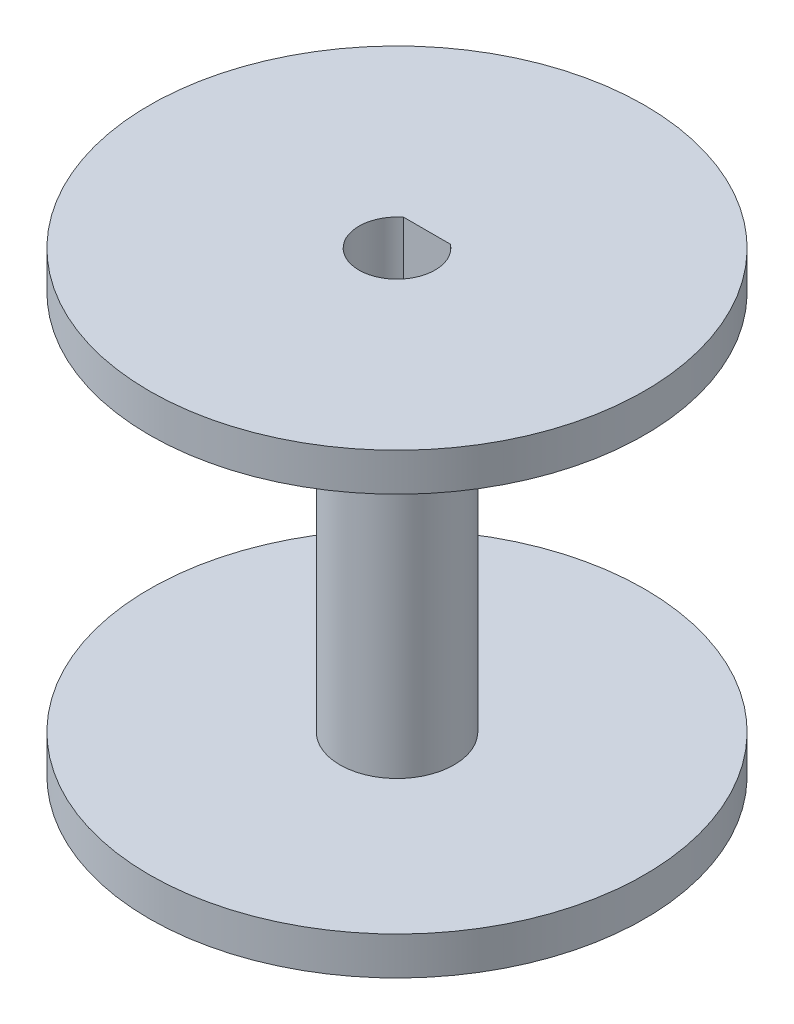
ISO-10303-21;
HEADER;
FILE_DESCRIPTION(('STEP AP214'),'2;1');
FILE_NAME('part.step','',(''),(''),'','','');
FILE_SCHEMA(('AUTOMOTIVE_DESIGN { 1 0 10303 214 1 1 1 1 }'));
ENDSEC;
DATA;
#1=APPLICATION_CONTEXT('core data for automotive mechanical design processes');
#2=APPLICATION_PROTOCOL_DEFINITION('international standard','automotive_design',2000,#1);
#3=PRODUCT_CONTEXT('',#1,'mechanical');
#4=PRODUCT('Part','Part','',(#3));
#5=PRODUCT_RELATED_PRODUCT_CATEGORY('part','',(#4));
#6=PRODUCT_DEFINITION_FORMATION('','',#4);
#7=PRODUCT_DEFINITION_CONTEXT('part definition',#1,'design');
#8=PRODUCT_DEFINITION('design','',#6,#7);
#9=PRODUCT_DEFINITION_SHAPE('','',#8);
#10=(LENGTH_UNIT() NAMED_UNIT(*) SI_UNIT(.MILLI.,.METRE.));
#11=(NAMED_UNIT(*) PLANE_ANGLE_UNIT() SI_UNIT($,.RADIAN.));
#12=(NAMED_UNIT(*) SI_UNIT($,.STERADIAN.) SOLID_ANGLE_UNIT());
#13=UNCERTAINTY_MEASURE_WITH_UNIT(LENGTH_MEASURE(1.E-05),#10,'distance_accuracy_value','');
#14=(GEOMETRIC_REPRESENTATION_CONTEXT(3) GLOBAL_UNCERTAINTY_ASSIGNED_CONTEXT((#13)) GLOBAL_UNIT_ASSIGNED_CONTEXT((#10,
#11,#12)) REPRESENTATION_CONTEXT('',''));
#15=CARTESIAN_POINT('',(0.,0.,0.));
#16=DIRECTION('',(0.,0.,1.));
#17=DIRECTION('',(1.,0.,0.));
#18=AXIS2_PLACEMENT_3D('',#15,#16,#17);
#19=CARTESIAN_POINT('',(0.,2.54,0.));
#20=DIRECTION('',(0.,1.,0.));
#21=DIRECTION('',(0.,0.,1.));
#22=AXIS2_PLACEMENT_3D('',#19,#20,#21);
#23=PLANE('',#22);
#24=CARTESIAN_POINT('',(0.,2.54,0.));
#25=DIRECTION('',(0.,1.,0.));
#26=DIRECTION('',(0.,0.,1.));
#27=AXIS2_PLACEMENT_3D('',#24,#25,#26);
#28=CIRCLE('',#27,3.81);
#29=CARTESIAN_POINT('',(0.,2.54,3.81));
#30=VERTEX_POINT('',#29);
#31=EDGE_CURVE('E54',#30,#30,#28,.T.);
#32=ORIENTED_EDGE('',*,*,#31,.F.);
#33=EDGE_LOOP('',(#32));
#34=FACE_BOUND('',#33,.T.);
#35=CARTESIAN_POINT('',(0.,2.54,0.));
#36=DIRECTION('',(0.,1.,0.));
#37=DIRECTION('',(0.,0.,1.));
#38=AXIS2_PLACEMENT_3D('',#35,#36,#37);
#39=CIRCLE('',#38,16.51);
#40=CARTESIAN_POINT('',(0.,2.54,16.51));
#41=VERTEX_POINT('',#40);
#42=EDGE_CURVE('E82',#41,#41,#39,.T.);
#43=ORIENTED_EDGE('',*,*,#42,.T.);
#44=EDGE_LOOP('',(#43));
#45=FACE_BOUND('',#44,.T.);
#46=ADVANCED_FACE('F44',(#34,#45),#23,.T.);
#47=CARTESIAN_POINT('',(0.,27.94,0.));
#48=DIRECTION('',(0.,-1.,0.));
#49=DIRECTION('',(0.,0.,-1.));
#50=AXIS2_PLACEMENT_3D('',#47,#48,#49);
#51=CYLINDRICAL_SURFACE('',#50,3.81);
#52=CARTESIAN_POINT('',(0.,27.94,0.));
#53=DIRECTION('',(0.,1.,0.));
#54=DIRECTION('',(0.,0.,1.));
#55=AXIS2_PLACEMENT_3D('',#52,#53,#54);
#56=CIRCLE('',#55,3.81);
#57=CARTESIAN_POINT('',(0.,27.94,3.81));
#58=VERTEX_POINT('',#57);
#59=EDGE_CURVE('E11',#58,#58,#56,.T.);
#60=ORIENTED_EDGE('',*,*,#59,.F.);
#61=EDGE_LOOP('',(#60));
#62=FACE_BOUND('',#61,.T.);
#63=ORIENTED_EDGE('',*,*,#31,.T.);
#64=EDGE_LOOP('',(#63));
#65=FACE_BOUND('',#64,.T.);
#66=ADVANCED_FACE('F102',(#62,#65),#51,.T.);
#67=CARTESIAN_POINT('',(0.,27.94,0.));
#68=DIRECTION('',(0.,1.,0.));
#69=DIRECTION('',(0.,0.,1.));
#70=AXIS2_PLACEMENT_3D('',#67,#68,#69);
#71=PLANE('',#70);
#72=ORIENTED_EDGE('',*,*,#59,.T.);
#73=EDGE_LOOP('',(#72));
#74=FACE_BOUND('',#73,.T.);
#75=CARTESIAN_POINT('',(0.,27.94,0.));
#76=DIRECTION('',(0.,1.,0.));
#77=DIRECTION('',(0.,0.,1.));
#78=AXIS2_PLACEMENT_3D('',#75,#76,#77);
#79=CIRCLE('',#78,16.51);
#80=CARTESIAN_POINT('',(0.,27.94,16.51));
#81=VERTEX_POINT('',#80);
#82=EDGE_CURVE('E48',#81,#81,#79,.T.);
#83=ORIENTED_EDGE('',*,*,#82,.F.);
#84=EDGE_LOOP('',(#83));
#85=FACE_BOUND('',#84,.T.);
#86=ADVANCED_FACE('F128',(#74,#85),#71,.F.);
#87=CARTESIAN_POINT('',(0.,-102.362,0.));
#88=DIRECTION('',(0.,1.,0.));
#89=DIRECTION('',(0.,0.,1.));
#90=AXIS2_PLACEMENT_3D('',#87,#88,#89);
#91=CYLINDRICAL_SURFACE('',#90,16.51);
#92=CARTESIAN_POINT('',(0.,30.48,0.));
#93=DIRECTION('',(0.,1.,0.));
#94=DIRECTION('',(0.,0.,1.));
#95=AXIS2_PLACEMENT_3D('',#92,#93,#94);
#96=CIRCLE('',#95,16.51);
#97=CARTESIAN_POINT('',(0.,30.48,16.51));
#98=VERTEX_POINT('',#97);
#99=EDGE_CURVE('E118',#98,#98,#96,.T.);
#100=ORIENTED_EDGE('',*,*,#99,.F.);
#101=EDGE_LOOP('',(#100));
#102=FACE_BOUND('',#101,.T.);
#103=ORIENTED_EDGE('',*,*,#82,.T.);
#104=EDGE_LOOP('',(#103));
#105=FACE_BOUND('',#104,.T.);
#106=ADVANCED_FACE('F126',(#102,#105),#91,.T.);
#107=CARTESIAN_POINT('',(0.,0.,0.));
#108=DIRECTION('',(0.,1.,0.));
#109=DIRECTION('',(0.,0.,1.));
#110=AXIS2_PLACEMENT_3D('',#107,#108,#109);
#111=PLANE('',#110);
#112=CARTESIAN_POINT('',(0.,0.,0.));
#113=DIRECTION('',(0.,1.,0.));
#114=DIRECTION('',(0.,0.,1.));
#115=AXIS2_PLACEMENT_3D('',#112,#113,#114);
#116=CIRCLE('',#115,2.54);
#117=CARTESIAN_POINT('',(-1.55729137928649,0.,-2.0066));
#118=VERTEX_POINT('',#117);
#119=CARTESIAN_POINT('',(1.55729137928649,0.,-2.0066));
#120=VERTEX_POINT('',#119);
#121=EDGE_CURVE('E87',#118,#120,#116,.T.);
#122=ORIENTED_EDGE('',*,*,#121,.T.);
#123=DIRECTION('',(-1.,0.,0.));
#124=VECTOR('',#123,1.);
#125=CARTESIAN_POINT('',(0.,0.,-2.0066));
#126=LINE('',#125,#124);
#127=EDGE_CURVE('E68',#120,#118,#126,.T.);
#128=ORIENTED_EDGE('',*,*,#127,.T.);
#129=EDGE_LOOP('',(#122,#128));
#130=FACE_BOUND('',#129,.T.);
#131=CARTESIAN_POINT('',(0.,0.,0.));
#132=DIRECTION('',(0.,1.,0.));
#133=DIRECTION('',(0.,0.,1.));
#134=AXIS2_PLACEMENT_3D('',#131,#132,#133);
#135=CIRCLE('',#134,16.51);
#136=CARTESIAN_POINT('',(0.,0.,16.51));
#137=VERTEX_POINT('',#136);
#138=EDGE_CURVE('E110',#137,#137,#135,.T.);
#139=ORIENTED_EDGE('',*,*,#138,.F.);
#140=EDGE_LOOP('',(#139));
#141=FACE_BOUND('',#140,.T.);
#142=ADVANCED_FACE('F46',(#130,#141),#111,.F.);
#143=CARTESIAN_POINT('',(0.,30.48,0.));
#144=DIRECTION('',(0.,1.,0.));
#145=DIRECTION('',(0.,0.,1.));
#146=AXIS2_PLACEMENT_3D('',#143,#144,#145);
#147=PLANE('',#146);
#148=CARTESIAN_POINT('',(0.,30.48,0.));
#149=DIRECTION('',(0.,-1.,0.));
#150=DIRECTION('',(0.,0.,-1.));
#151=AXIS2_PLACEMENT_3D('',#148,#149,#150);
#152=CIRCLE('',#151,2.54);
#153=CARTESIAN_POINT('',(1.55729137928649,30.48,-2.0066));
#154=VERTEX_POINT('',#153);
#155=CARTESIAN_POINT('',(-1.55729137928649,30.48,-2.0066));
#156=VERTEX_POINT('',#155);
#157=EDGE_CURVE('E86',#154,#156,#152,.T.);
#158=ORIENTED_EDGE('',*,*,#157,.T.);
#159=DIRECTION('',(1.,0.,0.));
#160=VECTOR('',#159,1.);
#161=CARTESIAN_POINT('',(0.,30.48,-2.0066));
#162=LINE('',#161,#160);
#163=EDGE_CURVE('E61',#156,#154,#162,.T.);
#164=ORIENTED_EDGE('',*,*,#163,.T.);
#165=EDGE_LOOP('',(#158,#164));
#166=FACE_BOUND('',#165,.T.);
#167=ORIENTED_EDGE('',*,*,#99,.T.);
#168=EDGE_LOOP('',(#167));
#169=FACE_BOUND('',#168,.T.);
#170=ADVANCED_FACE('F90',(#166,#169),#147,.T.);
#171=CARTESIAN_POINT('',(0.,27.94,0.));
#172=DIRECTION('',(0.,-1.,0.));
#173=DIRECTION('',(0.,0.,-1.));
#174=AXIS2_PLACEMENT_3D('',#171,#172,#173);
#175=CYLINDRICAL_SURFACE('',#174,2.54);
#176=DIRECTION('',(0.,1.,0.));
#177=VECTOR('',#176,1.);
#178=CARTESIAN_POINT('',(-1.55729137928649,-3.15992742321719,-2.0066));
#179=LINE('',#178,#177);
#180=EDGE_CURVE('E76',#118,#156,#179,.T.);
#181=ORIENTED_EDGE('',*,*,#180,.T.);
#182=ORIENTED_EDGE('',*,*,#157,.F.);
#183=DIRECTION('',(0.,1.,0.));
#184=VECTOR('',#183,1.);
#185=CARTESIAN_POINT('',(1.55729137928649,-3.15992742321719,-2.0066));
#186=LINE('',#185,#184);
#187=EDGE_CURVE('E79',#120,#154,#186,.T.);
#188=ORIENTED_EDGE('',*,*,#187,.F.);
#189=ORIENTED_EDGE('',*,*,#121,.F.);
#190=EDGE_LOOP('',(#181,#182,#188,#189));
#191=FACE_BOUND('',#190,.T.);
#192=ADVANCED_FACE('F85',(#191),#175,.F.);
#193=CARTESIAN_POINT('',(0.,-3.15992742321719,-2.0066));
#194=DIRECTION('',(0.,0.,1.));
#195=DIRECTION('',(1.,0.,0.));
#196=AXIS2_PLACEMENT_3D('',#193,#194,#195);
#197=PLANE('',#196);
#198=ORIENTED_EDGE('',*,*,#127,.F.);
#199=ORIENTED_EDGE('',*,*,#187,.T.);
#200=ORIENTED_EDGE('',*,*,#163,.F.);
#201=ORIENTED_EDGE('',*,*,#180,.F.);
#202=EDGE_LOOP('',(#198,#199,#200,#201));
#203=FACE_BOUND('',#202,.T.);
#204=ADVANCED_FACE('F75',(#203),#197,.T.);
#205=ORIENTED_EDGE('',*,*,#42,.F.);
#206=EDGE_LOOP('',(#205));
#207=FACE_BOUND('',#206,.T.);
#208=ORIENTED_EDGE('',*,*,#138,.T.);
#209=EDGE_LOOP('',(#208));
#210=FACE_BOUND('',#209,.T.);
#211=ADVANCED_FACE('F138',(#207,#210),#91,.T.);
#212=CLOSED_SHELL('',(#46,#66,#86,#106,#142,#170,#192,#204,#211));
#213=MANIFOLD_SOLID_BREP('B2',#212);
#214=ADVANCED_BREP_SHAPE_REPRESENTATION('',(#18,#213),#14);
#215=SHAPE_DEFINITION_REPRESENTATION(#9,#214);
ENDSEC;
END-ISO-10303-21;
